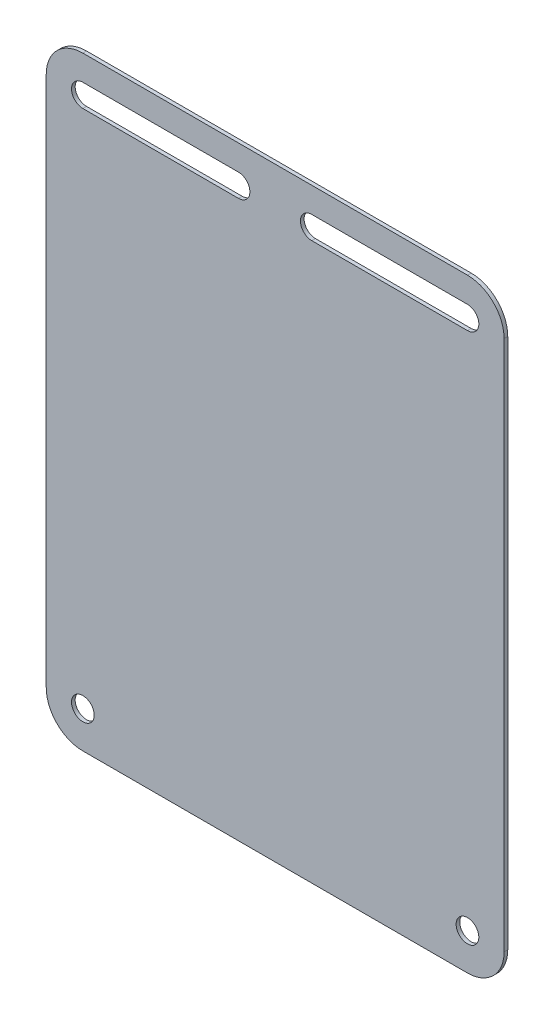
ISO-10303-21;
HEADER;
FILE_DESCRIPTION(('STEP AP214'),'2;1');
FILE_NAME('part.step','',(''),(''),'','','');
FILE_SCHEMA(('AUTOMOTIVE_DESIGN { 1 0 10303 214 1 1 1 1 }'));
ENDSEC;
DATA;
#1=APPLICATION_CONTEXT('core data for automotive mechanical design processes');
#2=APPLICATION_PROTOCOL_DEFINITION('international standard','automotive_design',2000,#1);
#3=PRODUCT_CONTEXT('',#1,'mechanical');
#4=PRODUCT('Part','Part','',(#3));
#5=PRODUCT_RELATED_PRODUCT_CATEGORY('part','',(#4));
#6=PRODUCT_DEFINITION_FORMATION('','',#4);
#7=PRODUCT_DEFINITION_CONTEXT('part definition',#1,'design');
#8=PRODUCT_DEFINITION('design','',#6,#7);
#9=PRODUCT_DEFINITION_SHAPE('','',#8);
#10=(LENGTH_UNIT() NAMED_UNIT(*) SI_UNIT(.MILLI.,.METRE.));
#11=(NAMED_UNIT(*) PLANE_ANGLE_UNIT() SI_UNIT($,.RADIAN.));
#12=(NAMED_UNIT(*) SI_UNIT($,.STERADIAN.) SOLID_ANGLE_UNIT());
#13=UNCERTAINTY_MEASURE_WITH_UNIT(LENGTH_MEASURE(1.E-05),#10,'distance_accuracy_value','');
#14=(GEOMETRIC_REPRESENTATION_CONTEXT(3) GLOBAL_UNCERTAINTY_ASSIGNED_CONTEXT((#13)) GLOBAL_UNIT_ASSIGNED_CONTEXT((#10,
#11,#12)) REPRESENTATION_CONTEXT('',''));
#15=CARTESIAN_POINT('',(0.,0.,0.));
#16=DIRECTION('',(0.,0.,1.));
#17=DIRECTION('',(1.,0.,0.));
#18=AXIS2_PLACEMENT_3D('',#15,#16,#17);
#19=CARTESIAN_POINT('',(0.,0.,1.));
#20=DIRECTION('',(0.,0.,1.));
#21=DIRECTION('',(1.,0.,0.));
#22=AXIS2_PLACEMENT_3D('',#19,#20,#21);
#23=PLANE('',#22);
#24=CARTESIAN_POINT('',(107.54347826087,-128.076086956522,1.));
#25=DIRECTION('',(0.,0.,1.));
#26=DIRECTION('',(1.,0.,0.));
#27=AXIS2_PLACEMENT_3D('',#24,#25,#26);
#28=CIRCLE('',#27,3.1);
#29=CARTESIAN_POINT('',(110.64347826087,-128.076086956522,1.));
#30=VERTEX_POINT('',#29);
#31=EDGE_CURVE('E196',#30,#30,#28,.T.);
#32=ORIENTED_EDGE('',*,*,#31,.F.);
#33=EDGE_LOOP('',(#32));
#34=FACE_BOUND('',#33,.T.);
#35=DIRECTION('',(1.,0.,0.));
#36=VECTOR('',#35,1.);
#37=CARTESIAN_POINT('',(-7.45652173913042,-138.076086956522,1.));
#38=LINE('',#37,#36);
#39=CARTESIAN_POINT('',(2.54347826086958,-138.076086956522,1.));
#40=VERTEX_POINT('',#39);
#41=CARTESIAN_POINT('',(107.54347826087,-138.076086956522,1.));
#42=VERTEX_POINT('',#41);
#43=EDGE_CURVE('E236',#40,#42,#38,.T.);
#44=ORIENTED_EDGE('',*,*,#43,.T.);
#45=CARTESIAN_POINT('',(107.54347826087,-128.076086956522,1.));
#46=DIRECTION('',(0.,0.,1.));
#47=DIRECTION('',(1.,0.,0.));
#48=AXIS2_PLACEMENT_3D('',#45,#46,#47);
#49=CIRCLE('',#48,10.);
#50=CARTESIAN_POINT('',(117.54347826087,-128.076086956522,1.));
#51=VERTEX_POINT('',#50);
#52=EDGE_CURVE('E276',#42,#51,#49,.T.);
#53=ORIENTED_EDGE('',*,*,#52,.T.);
#54=DIRECTION('',(0.,1.,0.));
#55=VECTOR('',#54,1.);
#56=CARTESIAN_POINT('',(117.54347826087,26.9239130434783,1.));
#57=LINE('',#56,#55);
#58=CARTESIAN_POINT('',(117.54347826087,16.9239130434783,1.));
#59=VERTEX_POINT('',#58);
#60=EDGE_CURVE('E240',#51,#59,#57,.T.);
#61=ORIENTED_EDGE('',*,*,#60,.T.);
#62=CARTESIAN_POINT('',(107.54347826087,16.9239130434783,1.));
#63=DIRECTION('',(0.,0.,1.));
#64=DIRECTION('',(1.,0.,0.));
#65=AXIS2_PLACEMENT_3D('',#62,#63,#64);
#66=CIRCLE('',#65,10.);
#67=CARTESIAN_POINT('',(107.54347826087,26.9239130434783,1.));
#68=VERTEX_POINT('',#67);
#69=EDGE_CURVE('E55',#59,#68,#66,.T.);
#70=ORIENTED_EDGE('',*,*,#69,.T.);
#71=DIRECTION('',(-1.,0.,0.));
#72=VECTOR('',#71,1.);
#73=CARTESIAN_POINT('',(-7.45652173913042,26.9239130434783,1.));
#74=LINE('',#73,#72);
#75=CARTESIAN_POINT('',(2.54347826086958,26.9239130434783,1.));
#76=VERTEX_POINT('',#75);
#77=EDGE_CURVE('E242',#68,#76,#74,.T.);
#78=ORIENTED_EDGE('',*,*,#77,.T.);
#79=CARTESIAN_POINT('',(2.54347826086958,16.9239130434783,1.));
#80=DIRECTION('',(0.,0.,1.));
#81=DIRECTION('',(1.,0.,0.));
#82=AXIS2_PLACEMENT_3D('',#79,#80,#81);
#83=CIRCLE('',#82,10.);
#84=CARTESIAN_POINT('',(-7.45652173913042,16.9239130434783,1.));
#85=VERTEX_POINT('',#84);
#86=EDGE_CURVE('E272',#76,#85,#83,.T.);
#87=ORIENTED_EDGE('',*,*,#86,.T.);
#88=DIRECTION('',(0.,-1.,0.));
#89=VECTOR('',#88,1.);
#90=CARTESIAN_POINT('',(-7.45652173913042,26.9239130434783,1.));
#91=LINE('',#90,#89);
#92=CARTESIAN_POINT('',(-7.45652173913042,-128.076086956522,1.));
#93=VERTEX_POINT('',#92);
#94=EDGE_CURVE('E233',#85,#93,#91,.T.);
#95=ORIENTED_EDGE('',*,*,#94,.T.);
#96=CARTESIAN_POINT('',(2.54347826086958,-128.076086956522,1.));
#97=DIRECTION('',(0.,0.,1.));
#98=DIRECTION('',(1.,0.,0.));
#99=AXIS2_PLACEMENT_3D('',#96,#97,#98);
#100=CIRCLE('',#99,10.);
#101=EDGE_CURVE('E274',#93,#40,#100,.T.);
#102=ORIENTED_EDGE('',*,*,#101,.T.);
#103=EDGE_LOOP('',(#44,#53,#61,#70,#78,#87,#95,#102));
#104=FACE_BOUND('',#103,.T.);
#105=DIRECTION('',(-1.,0.,0.));
#106=VECTOR('',#105,1.);
#107=CARTESIAN_POINT('',(45.0434782608696,20.0239130434783,1.));
#108=LINE('',#107,#106);
#109=CARTESIAN_POINT('',(45.0434782608696,20.0239130434783,1.));
#110=VERTEX_POINT('',#109);
#111=CARTESIAN_POINT('',(2.54347826086956,20.0239130434783,1.));
#112=VERTEX_POINT('',#111);
#113=EDGE_CURVE('E204',#110,#112,#108,.T.);
#114=ORIENTED_EDGE('',*,*,#113,.F.);
#115=CARTESIAN_POINT('',(45.0434782608696,16.9239130434783,1.));
#116=DIRECTION('',(0.,0.,1.));
#117=DIRECTION('',(-1.,0.,0.));
#118=AXIS2_PLACEMENT_3D('',#115,#116,#117);
#119=CIRCLE('',#118,3.1);
#120=CARTESIAN_POINT('',(45.0434782608696,13.8239130434783,1.));
#121=VERTEX_POINT('',#120);
#122=EDGE_CURVE('E202',#121,#110,#119,.T.);
#123=ORIENTED_EDGE('',*,*,#122,.F.);
#124=DIRECTION('',(1.,0.,0.));
#125=VECTOR('',#124,1.);
#126=CARTESIAN_POINT('',(45.0434782608696,13.8239130434783,1.));
#127=LINE('',#126,#125);
#128=CARTESIAN_POINT('',(2.54347826086956,13.8239130434783,1.));
#129=VERTEX_POINT('',#128);
#130=EDGE_CURVE('E210',#129,#121,#127,.T.);
#131=ORIENTED_EDGE('',*,*,#130,.F.);
#132=CARTESIAN_POINT('',(2.54347826086956,16.9239130434783,1.));
#133=DIRECTION('',(0.,0.,1.));
#134=DIRECTION('',(1.,0.,0.));
#135=AXIS2_PLACEMENT_3D('',#132,#133,#134);
#136=CIRCLE('',#135,3.1);
#137=EDGE_CURVE('E207',#112,#129,#136,.T.);
#138=ORIENTED_EDGE('',*,*,#137,.F.);
#139=EDGE_LOOP('',(#114,#123,#131,#138));
#140=FACE_BOUND('',#139,.T.);
#141=CARTESIAN_POINT('',(2.54347826086957,-128.076086956522,1.));
#142=DIRECTION('',(0.,0.,1.));
#143=DIRECTION('',(-1.,0.,0.));
#144=AXIS2_PLACEMENT_3D('',#141,#142,#143);
#145=CIRCLE('',#144,3.1);
#146=CARTESIAN_POINT('',(-0.556521739130431,-128.076086956522,1.));
#147=VERTEX_POINT('',#146);
#148=EDGE_CURVE('E190',#147,#147,#145,.T.);
#149=ORIENTED_EDGE('',*,*,#148,.F.);
#150=EDGE_LOOP('',(#149));
#151=FACE_BOUND('',#150,.T.);
#152=DIRECTION('',(-1.,0.,0.));
#153=VECTOR('',#152,1.);
#154=CARTESIAN_POINT('',(107.54347826087,20.0239130434783,1.));
#155=LINE('',#154,#153);
#156=CARTESIAN_POINT('',(107.54347826087,20.0239130434783,1.));
#157=VERTEX_POINT('',#156);
#158=CARTESIAN_POINT('',(65.0434782608696,20.0239130434783,1.));
#159=VERTEX_POINT('',#158);
#160=EDGE_CURVE('E159',#157,#159,#155,.T.);
#161=ORIENTED_EDGE('',*,*,#160,.F.);
#162=CARTESIAN_POINT('',(107.54347826087,16.9239130434783,1.));
#163=DIRECTION('',(0.,0.,1.));
#164=DIRECTION('',(-1.,0.,0.));
#165=AXIS2_PLACEMENT_3D('',#162,#163,#164);
#166=CIRCLE('',#165,3.1);
#167=CARTESIAN_POINT('',(107.54347826087,13.8239130434783,1.));
#168=VERTEX_POINT('',#167);
#169=EDGE_CURVE('E149',#168,#157,#166,.T.);
#170=ORIENTED_EDGE('',*,*,#169,.F.);
#171=DIRECTION('',(1.,0.,0.));
#172=VECTOR('',#171,1.);
#173=CARTESIAN_POINT('',(107.54347826087,13.8239130434783,1.));
#174=LINE('',#173,#172);
#175=CARTESIAN_POINT('',(65.0434782608696,13.8239130434783,1.));
#176=VERTEX_POINT('',#175);
#177=EDGE_CURVE('E174',#176,#168,#174,.T.);
#178=ORIENTED_EDGE('',*,*,#177,.F.);
#179=CARTESIAN_POINT('',(65.0434782608696,16.9239130434783,1.));
#180=DIRECTION('',(0.,0.,1.));
#181=DIRECTION('',(1.,0.,0.));
#182=AXIS2_PLACEMENT_3D('',#179,#180,#181);
#183=CIRCLE('',#182,3.1);
#184=EDGE_CURVE('E172',#159,#176,#183,.T.);
#185=ORIENTED_EDGE('',*,*,#184,.F.);
#186=EDGE_LOOP('',(#161,#170,#178,#185));
#187=FACE_BOUND('',#186,.T.);
#188=ADVANCED_FACE('F35',(#34,#104,#140,#151,#187),#23,.T.);
#189=CARTESIAN_POINT('',(0.,0.,0.));
#190=DIRECTION('',(0.,0.,1.));
#191=DIRECTION('',(1.,0.,0.));
#192=AXIS2_PLACEMENT_3D('',#189,#190,#191);
#193=PLANE('',#192);
#194=CARTESIAN_POINT('',(2.54347826086957,-128.076086956522,0.));
#195=DIRECTION('',(0.,0.,1.));
#196=DIRECTION('',(-1.,0.,0.));
#197=AXIS2_PLACEMENT_3D('',#194,#195,#196);
#198=CIRCLE('',#197,3.1);
#199=CARTESIAN_POINT('',(-0.556521739130431,-128.076086956522,0.));
#200=VERTEX_POINT('',#199);
#201=EDGE_CURVE('E167',#200,#200,#198,.T.);
#202=ORIENTED_EDGE('',*,*,#201,.T.);
#203=EDGE_LOOP('',(#202));
#204=FACE_BOUND('',#203,.T.);
#205=CARTESIAN_POINT('',(107.54347826087,-128.076086956522,0.));
#206=DIRECTION('',(0.,0.,1.));
#207=DIRECTION('',(1.,0.,0.));
#208=AXIS2_PLACEMENT_3D('',#205,#206,#207);
#209=CIRCLE('',#208,3.1);
#210=CARTESIAN_POINT('',(110.64347826087,-128.076086956522,0.));
#211=VERTEX_POINT('',#210);
#212=EDGE_CURVE('E193',#211,#211,#209,.T.);
#213=ORIENTED_EDGE('',*,*,#212,.T.);
#214=EDGE_LOOP('',(#213));
#215=FACE_BOUND('',#214,.T.);
#216=CARTESIAN_POINT('',(45.0434782608696,16.9239130434783,0.));
#217=DIRECTION('',(0.,0.,1.));
#218=DIRECTION('',(-1.,0.,0.));
#219=AXIS2_PLACEMENT_3D('',#216,#217,#218);
#220=CIRCLE('',#219,3.1);
#221=CARTESIAN_POINT('',(45.0434782608696,13.8239130434783,0.));
#222=VERTEX_POINT('',#221);
#223=CARTESIAN_POINT('',(45.0434782608696,20.0239130434783,0.));
#224=VERTEX_POINT('',#223);
#225=EDGE_CURVE('E199',#222,#224,#220,.T.);
#226=ORIENTED_EDGE('',*,*,#225,.T.);
#227=DIRECTION('',(-1.,0.,0.));
#228=VECTOR('',#227,1.);
#229=CARTESIAN_POINT('',(45.0434782608696,20.0239130434783,0.));
#230=LINE('',#229,#228);
#231=CARTESIAN_POINT('',(2.54347826086956,20.0239130434783,0.));
#232=VERTEX_POINT('',#231);
#233=EDGE_CURVE('E215',#224,#232,#230,.T.);
#234=ORIENTED_EDGE('',*,*,#233,.T.);
#235=CARTESIAN_POINT('',(2.54347826086956,16.9239130434783,0.));
#236=DIRECTION('',(0.,0.,1.));
#237=DIRECTION('',(1.,0.,0.));
#238=AXIS2_PLACEMENT_3D('',#235,#236,#237);
#239=CIRCLE('',#238,3.1);
#240=CARTESIAN_POINT('',(2.54347826086956,13.8239130434783,0.));
#241=VERTEX_POINT('',#240);
#242=EDGE_CURVE('E218',#232,#241,#239,.T.);
#243=ORIENTED_EDGE('',*,*,#242,.T.);
#244=DIRECTION('',(1.,0.,0.));
#245=VECTOR('',#244,1.);
#246=CARTESIAN_POINT('',(45.0434782608696,13.8239130434783,0.));
#247=LINE('',#246,#245);
#248=EDGE_CURVE('E205',#241,#222,#247,.T.);
#249=ORIENTED_EDGE('',*,*,#248,.T.);
#250=EDGE_LOOP('',(#226,#234,#243,#249));
#251=FACE_BOUND('',#250,.T.);
#252=DIRECTION('',(0.,1.,0.));
#253=VECTOR('',#252,1.);
#254=CARTESIAN_POINT('',(117.54347826087,26.9239130434783,0.));
#255=LINE('',#254,#253);
#256=CARTESIAN_POINT('',(117.54347826087,-128.076086956522,0.));
#257=VERTEX_POINT('',#256);
#258=CARTESIAN_POINT('',(117.54347826087,16.9239130434783,0.));
#259=VERTEX_POINT('',#258);
#260=EDGE_CURVE('E250',#257,#259,#255,.T.);
#261=ORIENTED_EDGE('',*,*,#260,.F.);
#262=CARTESIAN_POINT('',(107.54347826087,-128.076086956522,0.));
#263=DIRECTION('',(0.,0.,1.));
#264=DIRECTION('',(1.,0.,0.));
#265=AXIS2_PLACEMENT_3D('',#262,#263,#264);
#266=CIRCLE('',#265,10.);
#267=CARTESIAN_POINT('',(107.54347826087,-138.076086956522,0.));
#268=VERTEX_POINT('',#267);
#269=EDGE_CURVE('E264',#257,#268,#266,.F.);
#270=ORIENTED_EDGE('',*,*,#269,.T.);
#271=DIRECTION('',(1.,0.,0.));
#272=VECTOR('',#271,1.);
#273=CARTESIAN_POINT('',(-7.45652173913042,-138.076086956522,0.));
#274=LINE('',#273,#272);
#275=CARTESIAN_POINT('',(2.54347826086958,-138.076086956522,0.));
#276=VERTEX_POINT('',#275);
#277=EDGE_CURVE('E247',#276,#268,#274,.T.);
#278=ORIENTED_EDGE('',*,*,#277,.F.);
#279=CARTESIAN_POINT('',(2.54347826086958,-128.076086956522,0.));
#280=DIRECTION('',(0.,0.,1.));
#281=DIRECTION('',(1.,0.,0.));
#282=AXIS2_PLACEMENT_3D('',#279,#280,#281);
#283=CIRCLE('',#282,10.);
#284=CARTESIAN_POINT('',(-7.45652173913042,-128.076086956522,0.));
#285=VERTEX_POINT('',#284);
#286=EDGE_CURVE('E262',#276,#285,#283,.F.);
#287=ORIENTED_EDGE('',*,*,#286,.T.);
#288=DIRECTION('',(0.,-1.,0.));
#289=VECTOR('',#288,1.);
#290=CARTESIAN_POINT('',(-7.45652173913042,26.9239130434783,0.));
#291=LINE('',#290,#289);
#292=CARTESIAN_POINT('',(-7.45652173913042,16.9239130434783,0.));
#293=VERTEX_POINT('',#292);
#294=EDGE_CURVE('E232',#293,#285,#291,.T.);
#295=ORIENTED_EDGE('',*,*,#294,.F.);
#296=CARTESIAN_POINT('',(2.54347826086958,16.9239130434783,0.));
#297=DIRECTION('',(0.,0.,1.));
#298=DIRECTION('',(1.,0.,0.));
#299=AXIS2_PLACEMENT_3D('',#296,#297,#298);
#300=CIRCLE('',#299,10.);
#301=CARTESIAN_POINT('',(2.54347826086958,26.9239130434783,0.));
#302=VERTEX_POINT('',#301);
#303=EDGE_CURVE('E260',#293,#302,#300,.F.);
#304=ORIENTED_EDGE('',*,*,#303,.T.);
#305=DIRECTION('',(-1.,0.,0.));
#306=VECTOR('',#305,1.);
#307=CARTESIAN_POINT('',(-7.45652173913042,26.9239130434783,0.));
#308=LINE('',#307,#306);
#309=CARTESIAN_POINT('',(107.54347826087,26.9239130434783,0.));
#310=VERTEX_POINT('',#309);
#311=EDGE_CURVE('E237',#310,#302,#308,.T.);
#312=ORIENTED_EDGE('',*,*,#311,.F.);
#313=CARTESIAN_POINT('',(107.54347826087,16.9239130434783,0.));
#314=DIRECTION('',(0.,0.,1.));
#315=DIRECTION('',(1.,0.,0.));
#316=AXIS2_PLACEMENT_3D('',#313,#314,#315);
#317=CIRCLE('',#316,10.);
#318=EDGE_CURVE('E258',#310,#259,#317,.F.);
#319=ORIENTED_EDGE('',*,*,#318,.T.);
#320=EDGE_LOOP('',(#261,#270,#278,#287,#295,#304,#312,#319));
#321=FACE_BOUND('',#320,.T.);
#322=CARTESIAN_POINT('',(107.54347826087,16.9239130434783,0.));
#323=DIRECTION('',(0.,0.,1.));
#324=DIRECTION('',(-1.,0.,0.));
#325=AXIS2_PLACEMENT_3D('',#322,#323,#324);
#326=CIRCLE('',#325,3.1);
#327=CARTESIAN_POINT('',(107.54347826087,13.8239130434783,0.));
#328=VERTEX_POINT('',#327);
#329=CARTESIAN_POINT('',(107.54347826087,20.0239130434783,0.));
#330=VERTEX_POINT('',#329);
#331=EDGE_CURVE('E178',#328,#330,#326,.T.);
#332=ORIENTED_EDGE('',*,*,#331,.T.);
#333=DIRECTION('',(-1.,0.,0.));
#334=VECTOR('',#333,1.);
#335=CARTESIAN_POINT('',(107.54347826087,20.0239130434783,0.));
#336=LINE('',#335,#334);
#337=CARTESIAN_POINT('',(65.0434782608696,20.0239130434783,0.));
#338=VERTEX_POINT('',#337);
#339=EDGE_CURVE('E166',#330,#338,#336,.T.);
#340=ORIENTED_EDGE('',*,*,#339,.T.);
#341=CARTESIAN_POINT('',(65.0434782608696,16.9239130434783,0.));
#342=DIRECTION('',(0.,0.,1.));
#343=DIRECTION('',(1.,0.,0.));
#344=AXIS2_PLACEMENT_3D('',#341,#342,#343);
#345=CIRCLE('',#344,3.1);
#346=CARTESIAN_POINT('',(65.0434782608696,13.8239130434783,0.));
#347=VERTEX_POINT('',#346);
#348=EDGE_CURVE('E181',#338,#347,#345,.T.);
#349=ORIENTED_EDGE('',*,*,#348,.T.);
#350=DIRECTION('',(1.,0.,0.));
#351=VECTOR('',#350,1.);
#352=CARTESIAN_POINT('',(107.54347826087,13.8239130434783,0.));
#353=LINE('',#352,#351);
#354=EDGE_CURVE('E160',#347,#328,#353,.T.);
#355=ORIENTED_EDGE('',*,*,#354,.T.);
#356=EDGE_LOOP('',(#332,#340,#349,#355));
#357=FACE_BOUND('',#356,.T.);
#358=ADVANCED_FACE('F289',(#204,#215,#251,#321,#357),#193,.F.);
#359=CARTESIAN_POINT('',(-7.45652173913042,26.9239130434783,1.));
#360=DIRECTION('',(1.,0.,0.));
#361=DIRECTION('',(0.,0.,-1.));
#362=AXIS2_PLACEMENT_3D('',#359,#360,#361);
#363=PLANE('',#362);
#364=ORIENTED_EDGE('',*,*,#294,.T.);
#365=DIRECTION('',(0.,0.,-1.));
#366=VECTOR('',#365,1.);
#367=CARTESIAN_POINT('',(-7.45652173913042,-128.076086956522,1.));
#368=LINE('',#367,#366);
#369=EDGE_CURVE('E281',#285,#93,#368,.F.);
#370=ORIENTED_EDGE('',*,*,#369,.T.);
#371=ORIENTED_EDGE('',*,*,#94,.F.);
#372=DIRECTION('',(0.,0.,-1.));
#373=VECTOR('',#372,1.);
#374=CARTESIAN_POINT('',(-7.45652173913042,16.9239130434783,1.));
#375=LINE('',#374,#373);
#376=EDGE_CURVE('E278',#85,#293,#375,.T.);
#377=ORIENTED_EDGE('',*,*,#376,.T.);
#378=EDGE_LOOP('',(#364,#370,#371,#377));
#379=FACE_BOUND('',#378,.T.);
#380=ADVANCED_FACE('F298',(#379),#363,.F.);
#381=CARTESIAN_POINT('',(-7.45652173913042,-138.076086956522,1.));
#382=DIRECTION('',(0.,1.,0.));
#383=DIRECTION('',(-1.,0.,0.));
#384=AXIS2_PLACEMENT_3D('',#381,#382,#383);
#385=PLANE('',#384);
#386=ORIENTED_EDGE('',*,*,#277,.T.);
#387=DIRECTION('',(0.,0.,-1.));
#388=VECTOR('',#387,1.);
#389=CARTESIAN_POINT('',(107.54347826087,-138.076086956522,1.));
#390=LINE('',#389,#388);
#391=EDGE_CURVE('E269',#268,#42,#390,.F.);
#392=ORIENTED_EDGE('',*,*,#391,.T.);
#393=ORIENTED_EDGE('',*,*,#43,.F.);
#394=DIRECTION('',(0.,0.,-1.));
#395=VECTOR('',#394,1.);
#396=CARTESIAN_POINT('',(2.54347826086958,-138.076086956522,1.));
#397=LINE('',#396,#395);
#398=EDGE_CURVE('E266',#40,#276,#397,.T.);
#399=ORIENTED_EDGE('',*,*,#398,.T.);
#400=EDGE_LOOP('',(#386,#392,#393,#399));
#401=FACE_BOUND('',#400,.T.);
#402=ADVANCED_FACE('F308',(#401),#385,.F.);
#403=CARTESIAN_POINT('',(117.54347826087,26.9239130434783,1.));
#404=DIRECTION('',(-1.,0.,0.));
#405=DIRECTION('',(0.,-1.,0.));
#406=AXIS2_PLACEMENT_3D('',#403,#404,#405);
#407=PLANE('',#406);
#408=ORIENTED_EDGE('',*,*,#60,.F.);
#409=DIRECTION('',(0.,0.,-1.));
#410=VECTOR('',#409,1.);
#411=CARTESIAN_POINT('',(117.54347826087,-128.076086956522,1.));
#412=LINE('',#411,#410);
#413=EDGE_CURVE('E255',#51,#257,#412,.T.);
#414=ORIENTED_EDGE('',*,*,#413,.T.);
#415=ORIENTED_EDGE('',*,*,#260,.T.);
#416=DIRECTION('',(0.,0.,-1.));
#417=VECTOR('',#416,1.);
#418=CARTESIAN_POINT('',(117.54347826087,16.9239130434783,1.));
#419=LINE('',#418,#417);
#420=EDGE_CURVE('E244',#259,#59,#419,.F.);
#421=ORIENTED_EDGE('',*,*,#420,.T.);
#422=EDGE_LOOP('',(#408,#414,#415,#421));
#423=FACE_BOUND('',#422,.T.);
#424=ADVANCED_FACE('F316',(#423),#407,.F.);
#425=CARTESIAN_POINT('',(-7.45652173913042,26.9239130434783,1.));
#426=DIRECTION('',(0.,-1.,0.));
#427=DIRECTION('',(1.,0.,0.));
#428=AXIS2_PLACEMENT_3D('',#425,#426,#427);
#429=PLANE('',#428);
#430=ORIENTED_EDGE('',*,*,#311,.T.);
#431=DIRECTION('',(0.,0.,-1.));
#432=VECTOR('',#431,1.);
#433=CARTESIAN_POINT('',(2.54347826086958,26.9239130434783,1.));
#434=LINE('',#433,#432);
#435=EDGE_CURVE('E11',#302,#76,#434,.F.);
#436=ORIENTED_EDGE('',*,*,#435,.T.);
#437=ORIENTED_EDGE('',*,*,#77,.F.);
#438=DIRECTION('',(0.,0.,-1.));
#439=VECTOR('',#438,1.);
#440=CARTESIAN_POINT('',(107.54347826087,26.9239130434783,1.));
#441=LINE('',#440,#439);
#442=EDGE_CURVE('E43',#68,#310,#441,.T.);
#443=ORIENTED_EDGE('',*,*,#442,.T.);
#444=EDGE_LOOP('',(#430,#436,#437,#443));
#445=FACE_BOUND('',#444,.T.);
#446=ADVANCED_FACE('F285',(#445),#429,.F.);
#447=CARTESIAN_POINT('',(45.0434782608696,16.9239130434783,1.));
#448=DIRECTION('',(0.,0.,-1.));
#449=DIRECTION('',(-1.,0.,0.));
#450=AXIS2_PLACEMENT_3D('',#447,#448,#449);
#451=CYLINDRICAL_SURFACE('',#450,3.1);
#452=ORIENTED_EDGE('',*,*,#225,.F.);
#453=DIRECTION('',(0.,0.,-1.));
#454=VECTOR('',#453,1.);
#455=CARTESIAN_POINT('',(45.0434782608696,13.8239130434783,1.));
#456=LINE('',#455,#454);
#457=EDGE_CURVE('E212',#121,#222,#456,.T.);
#458=ORIENTED_EDGE('',*,*,#457,.F.);
#459=ORIENTED_EDGE('',*,*,#122,.T.);
#460=DIRECTION('',(0.,0.,-1.));
#461=VECTOR('',#460,1.);
#462=CARTESIAN_POINT('',(45.0434782608696,20.0239130434783,1.));
#463=LINE('',#462,#461);
#464=EDGE_CURVE('E229',#110,#224,#463,.T.);
#465=ORIENTED_EDGE('',*,*,#464,.T.);
#466=EDGE_LOOP('',(#452,#458,#459,#465));
#467=FACE_BOUND('',#466,.T.);
#468=ADVANCED_FACE('F332',(#467),#451,.F.);
#469=CARTESIAN_POINT('',(45.0434782608696,20.0239130434783,1.));
#470=DIRECTION('',(0.,-1.,0.));
#471=DIRECTION('',(1.,0.,0.));
#472=AXIS2_PLACEMENT_3D('',#469,#470,#471);
#473=PLANE('',#472);
#474=ORIENTED_EDGE('',*,*,#233,.F.);
#475=ORIENTED_EDGE('',*,*,#464,.F.);
#476=ORIENTED_EDGE('',*,*,#113,.T.);
#477=DIRECTION('',(0.,0.,-1.));
#478=VECTOR('',#477,1.);
#479=CARTESIAN_POINT('',(2.54347826086956,20.0239130434783,1.));
#480=LINE('',#479,#478);
#481=EDGE_CURVE('E227',#112,#232,#480,.T.);
#482=ORIENTED_EDGE('',*,*,#481,.T.);
#483=EDGE_LOOP('',(#474,#475,#476,#482));
#484=FACE_BOUND('',#483,.T.);
#485=ADVANCED_FACE('F435',(#484),#473,.T.);
#486=CARTESIAN_POINT('',(2.54347826086956,16.9239130434783,1.));
#487=DIRECTION('',(0.,0.,-1.));
#488=DIRECTION('',(-1.,0.,0.));
#489=AXIS2_PLACEMENT_3D('',#486,#487,#488);
#490=CYLINDRICAL_SURFACE('',#489,3.1);
#491=ORIENTED_EDGE('',*,*,#242,.F.);
#492=ORIENTED_EDGE('',*,*,#481,.F.);
#493=ORIENTED_EDGE('',*,*,#137,.T.);
#494=DIRECTION('',(0.,0.,-1.));
#495=VECTOR('',#494,1.);
#496=CARTESIAN_POINT('',(2.54347826086956,13.8239130434783,1.));
#497=LINE('',#496,#495);
#498=EDGE_CURVE('E225',#129,#241,#497,.T.);
#499=ORIENTED_EDGE('',*,*,#498,.T.);
#500=EDGE_LOOP('',(#491,#492,#493,#499));
#501=FACE_BOUND('',#500,.T.);
#502=ADVANCED_FACE('F426',(#501),#490,.F.);
#503=CARTESIAN_POINT('',(45.0434782608696,13.8239130434783,1.));
#504=DIRECTION('',(0.,1.,0.));
#505=DIRECTION('',(-1.,0.,0.));
#506=AXIS2_PLACEMENT_3D('',#503,#504,#505);
#507=PLANE('',#506);
#508=ORIENTED_EDGE('',*,*,#248,.F.);
#509=ORIENTED_EDGE('',*,*,#498,.F.);
#510=ORIENTED_EDGE('',*,*,#130,.T.);
#511=ORIENTED_EDGE('',*,*,#457,.T.);
#512=EDGE_LOOP('',(#508,#509,#510,#511));
#513=FACE_BOUND('',#512,.T.);
#514=ADVANCED_FACE('F417',(#513),#507,.T.);
#515=CARTESIAN_POINT('',(107.54347826087,-128.076086956522,1.));
#516=DIRECTION('',(0.,0.,-1.));
#517=DIRECTION('',(-1.,0.,0.));
#518=AXIS2_PLACEMENT_3D('',#515,#516,#517);
#519=CYLINDRICAL_SURFACE('',#518,3.1);
#520=ORIENTED_EDGE('',*,*,#31,.T.);
#521=EDGE_LOOP('',(#520));
#522=FACE_BOUND('',#521,.T.);
#523=ORIENTED_EDGE('',*,*,#212,.F.);
#524=EDGE_LOOP('',(#523));
#525=FACE_BOUND('',#524,.T.);
#526=ADVANCED_FACE('F408',(#522,#525),#519,.F.);
#527=CARTESIAN_POINT('',(2.54347826086957,-128.076086956522,1.));
#528=DIRECTION('',(0.,0.,-1.));
#529=DIRECTION('',(-1.,0.,0.));
#530=AXIS2_PLACEMENT_3D('',#527,#528,#529);
#531=CYLINDRICAL_SURFACE('',#530,3.1);
#532=ORIENTED_EDGE('',*,*,#148,.T.);
#533=EDGE_LOOP('',(#532));
#534=FACE_BOUND('',#533,.T.);
#535=ORIENTED_EDGE('',*,*,#201,.F.);
#536=EDGE_LOOP('',(#535));
#537=FACE_BOUND('',#536,.T.);
#538=ADVANCED_FACE('F400',(#534,#537),#531,.F.);
#539=CARTESIAN_POINT('',(107.54347826087,16.9239130434783,1.));
#540=DIRECTION('',(0.,0.,-1.));
#541=DIRECTION('',(-1.,0.,0.));
#542=AXIS2_PLACEMENT_3D('',#539,#540,#541);
#543=CYLINDRICAL_SURFACE('',#542,3.1);
#544=ORIENTED_EDGE('',*,*,#331,.F.);
#545=DIRECTION('',(0.,0.,-1.));
#546=VECTOR('',#545,1.);
#547=CARTESIAN_POINT('',(107.54347826087,13.8239130434783,1.));
#548=LINE('',#547,#546);
#549=EDGE_CURVE('E155',#168,#328,#548,.T.);
#550=ORIENTED_EDGE('',*,*,#549,.F.);
#551=ORIENTED_EDGE('',*,*,#169,.T.);
#552=DIRECTION('',(0.,0.,-1.));
#553=VECTOR('',#552,1.);
#554=CARTESIAN_POINT('',(107.54347826087,20.0239130434783,1.));
#555=LINE('',#554,#553);
#556=EDGE_CURVE('E152',#157,#330,#555,.T.);
#557=ORIENTED_EDGE('',*,*,#556,.T.);
#558=EDGE_LOOP('',(#544,#550,#551,#557));
#559=FACE_BOUND('',#558,.T.);
#560=ADVANCED_FACE('F151',(#559),#543,.F.);
#561=CARTESIAN_POINT('',(107.54347826087,20.0239130434783,1.));
#562=DIRECTION('',(0.,-1.,0.));
#563=DIRECTION('',(1.,0.,0.));
#564=AXIS2_PLACEMENT_3D('',#561,#562,#563);
#565=PLANE('',#564);
#566=ORIENTED_EDGE('',*,*,#339,.F.);
#567=ORIENTED_EDGE('',*,*,#556,.F.);
#568=ORIENTED_EDGE('',*,*,#160,.T.);
#569=DIRECTION('',(0.,0.,-1.));
#570=VECTOR('',#569,1.);
#571=CARTESIAN_POINT('',(65.0434782608696,20.0239130434783,1.));
#572=LINE('',#571,#570);
#573=EDGE_CURVE('E168',#159,#338,#572,.T.);
#574=ORIENTED_EDGE('',*,*,#573,.T.);
#575=EDGE_LOOP('',(#566,#567,#568,#574));
#576=FACE_BOUND('',#575,.T.);
#577=ADVANCED_FACE('F163',(#576),#565,.T.);
#578=CARTESIAN_POINT('',(65.0434782608696,16.9239130434783,1.));
#579=DIRECTION('',(0.,0.,-1.));
#580=DIRECTION('',(-1.,0.,0.));
#581=AXIS2_PLACEMENT_3D('',#578,#579,#580);
#582=CYLINDRICAL_SURFACE('',#581,3.1);
#583=ORIENTED_EDGE('',*,*,#348,.F.);
#584=ORIENTED_EDGE('',*,*,#573,.F.);
#585=ORIENTED_EDGE('',*,*,#184,.T.);
#586=DIRECTION('',(0.,0.,-1.));
#587=VECTOR('',#586,1.);
#588=CARTESIAN_POINT('',(65.0434782608696,13.8239130434783,1.));
#589=LINE('',#588,#587);
#590=EDGE_CURVE('E187',#176,#347,#589,.T.);
#591=ORIENTED_EDGE('',*,*,#590,.T.);
#592=EDGE_LOOP('',(#583,#584,#585,#591));
#593=FACE_BOUND('',#592,.T.);
#594=ADVANCED_FACE('F376',(#593),#582,.F.);
#595=CARTESIAN_POINT('',(107.54347826087,13.8239130434783,1.));
#596=DIRECTION('',(0.,1.,0.));
#597=DIRECTION('',(-1.,0.,0.));
#598=AXIS2_PLACEMENT_3D('',#595,#596,#597);
#599=PLANE('',#598);
#600=ORIENTED_EDGE('',*,*,#354,.F.);
#601=ORIENTED_EDGE('',*,*,#590,.F.);
#602=ORIENTED_EDGE('',*,*,#177,.T.);
#603=ORIENTED_EDGE('',*,*,#549,.T.);
#604=EDGE_LOOP('',(#600,#601,#602,#603));
#605=FACE_BOUND('',#604,.T.);
#606=ADVANCED_FACE('F345',(#605),#599,.T.);
#607=CARTESIAN_POINT('',(107.54347826087,-128.076086956522,1.));
#608=DIRECTION('',(0.,0.,-1.));
#609=DIRECTION('',(-1.,0.,0.));
#610=AXIS2_PLACEMENT_3D('',#607,#608,#609);
#611=CYLINDRICAL_SURFACE('',#610,10.);
#612=ORIENTED_EDGE('',*,*,#52,.F.);
#613=ORIENTED_EDGE('',*,*,#391,.F.);
#614=ORIENTED_EDGE('',*,*,#269,.F.);
#615=ORIENTED_EDGE('',*,*,#413,.F.);
#616=EDGE_LOOP('',(#612,#613,#614,#615));
#617=FACE_BOUND('',#616,.T.);
#618=ADVANCED_FACE('F313',(#617),#611,.T.);
#619=CARTESIAN_POINT('',(2.54347826086958,-128.076086956522,1.));
#620=DIRECTION('',(0.,0.,-1.));
#621=DIRECTION('',(-1.,0.,0.));
#622=AXIS2_PLACEMENT_3D('',#619,#620,#621);
#623=CYLINDRICAL_SURFACE('',#622,10.);
#624=ORIENTED_EDGE('',*,*,#101,.F.);
#625=ORIENTED_EDGE('',*,*,#369,.F.);
#626=ORIENTED_EDGE('',*,*,#286,.F.);
#627=ORIENTED_EDGE('',*,*,#398,.F.);
#628=EDGE_LOOP('',(#624,#625,#626,#627));
#629=FACE_BOUND('',#628,.T.);
#630=ADVANCED_FACE('F305',(#629),#623,.T.);
#631=CARTESIAN_POINT('',(2.54347826086958,16.9239130434783,1.));
#632=DIRECTION('',(0.,0.,-1.));
#633=DIRECTION('',(-1.,0.,0.));
#634=AXIS2_PLACEMENT_3D('',#631,#632,#633);
#635=CYLINDRICAL_SURFACE('',#634,10.);
#636=ORIENTED_EDGE('',*,*,#86,.F.);
#637=ORIENTED_EDGE('',*,*,#435,.F.);
#638=ORIENTED_EDGE('',*,*,#303,.F.);
#639=ORIENTED_EDGE('',*,*,#376,.F.);
#640=EDGE_LOOP('',(#636,#637,#638,#639));
#641=FACE_BOUND('',#640,.T.);
#642=ADVANCED_FACE('F295',(#641),#635,.T.);
#643=CARTESIAN_POINT('',(107.54347826087,16.9239130434783,1.));
#644=DIRECTION('',(0.,0.,-1.));
#645=DIRECTION('',(-1.,0.,0.));
#646=AXIS2_PLACEMENT_3D('',#643,#644,#645);
#647=CYLINDRICAL_SURFACE('',#646,10.);
#648=ORIENTED_EDGE('',*,*,#69,.F.);
#649=ORIENTED_EDGE('',*,*,#420,.F.);
#650=ORIENTED_EDGE('',*,*,#318,.F.);
#651=ORIENTED_EDGE('',*,*,#442,.F.);
#652=EDGE_LOOP('',(#648,#649,#650,#651));
#653=FACE_BOUND('',#652,.T.);
#654=ADVANCED_FACE('F37',(#653),#647,.T.);
#655=CLOSED_SHELL('',(#188,#358,#380,#402,#424,#446,#468,#485,#502,#514,#526,#538,#560,#577,
#594,#606,#618,#630,#642,#654));
#656=MANIFOLD_SOLID_BREP('B2',#655);
#657=ADVANCED_BREP_SHAPE_REPRESENTATION('',(#18,#656),#14);
#658=SHAPE_DEFINITION_REPRESENTATION(#9,#657);
ENDSEC;
END-ISO-10303-21;
